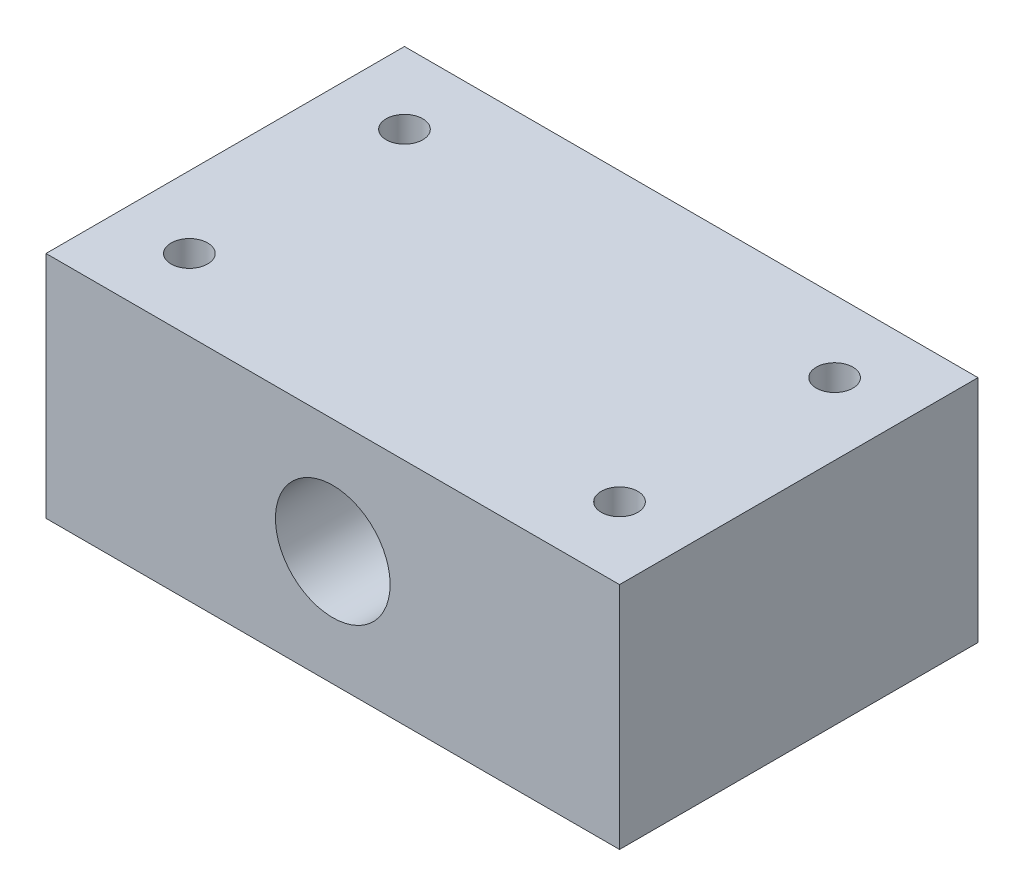
ISO-10303-21;
HEADER;
FILE_DESCRIPTION(('STEP AP214'),'2;1');
FILE_NAME('part.step','',(''),(''),'','','');
FILE_SCHEMA(('AUTOMOTIVE_DESIGN { 1 0 10303 214 1 1 1 1 }'));
ENDSEC;
DATA;
#1=APPLICATION_CONTEXT('core data for automotive mechanical design processes');
#2=APPLICATION_PROTOCOL_DEFINITION('international standard','automotive_design',2000,#1);
#3=PRODUCT_CONTEXT('',#1,'mechanical');
#4=PRODUCT('Part','Part','',(#3));
#5=PRODUCT_RELATED_PRODUCT_CATEGORY('part','',(#4));
#6=PRODUCT_DEFINITION_FORMATION('','',#4);
#7=PRODUCT_DEFINITION_CONTEXT('part definition',#1,'design');
#8=PRODUCT_DEFINITION('design','',#6,#7);
#9=PRODUCT_DEFINITION_SHAPE('','',#8);
#10=(LENGTH_UNIT() NAMED_UNIT(*) SI_UNIT(.MILLI.,.METRE.));
#11=(NAMED_UNIT(*) PLANE_ANGLE_UNIT() SI_UNIT($,.RADIAN.));
#12=(NAMED_UNIT(*) SI_UNIT($,.STERADIAN.) SOLID_ANGLE_UNIT());
#13=UNCERTAINTY_MEASURE_WITH_UNIT(LENGTH_MEASURE(1.E-05),#10,'distance_accuracy_value','');
#14=(GEOMETRIC_REPRESENTATION_CONTEXT(3) GLOBAL_UNCERTAINTY_ASSIGNED_CONTEXT((#13)) GLOBAL_UNIT_ASSIGNED_CONTEXT((#10,
#11,#12)) REPRESENTATION_CONTEXT('',''));
#15=CARTESIAN_POINT('',(0.,0.,0.));
#16=DIRECTION('',(0.,0.,1.));
#17=DIRECTION('',(1.,0.,0.));
#18=AXIS2_PLACEMENT_3D('',#15,#16,#17);
#19=CARTESIAN_POINT('',(0.,32.,0.));
#20=DIRECTION('',(0.,1.,0.));
#21=DIRECTION('',(0.,0.,1.));
#22=AXIS2_PLACEMENT_3D('',#19,#20,#21);
#23=PLANE('',#22);
#24=CARTESIAN_POINT('',(30.,32.,15.));
#25=DIRECTION('',(0.,1.,0.));
#26=DIRECTION('',(0.,0.,1.));
#27=AXIS2_PLACEMENT_3D('',#24,#25,#26);
#28=CIRCLE('',#27,2.55);
#29=CARTESIAN_POINT('',(30.,32.,17.55));
#30=VERTEX_POINT('',#29);
#31=EDGE_CURVE('E121',#30,#30,#28,.T.);
#32=ORIENTED_EDGE('',*,*,#31,.F.);
#33=EDGE_LOOP('',(#32));
#34=FACE_BOUND('',#33,.T.);
#35=CARTESIAN_POINT('',(-30.,32.,-15.));
#36=DIRECTION('',(0.,1.,0.));
#37=DIRECTION('',(0.,0.,1.));
#38=AXIS2_PLACEMENT_3D('',#35,#36,#37);
#39=CIRCLE('',#38,2.55);
#40=CARTESIAN_POINT('',(-30.,32.,-12.45));
#41=VERTEX_POINT('',#40);
#42=EDGE_CURVE('E100',#41,#41,#39,.T.);
#43=ORIENTED_EDGE('',*,*,#42,.F.);
#44=EDGE_LOOP('',(#43));
#45=FACE_BOUND('',#44,.T.);
#46=DIRECTION('',(0.,0.,-1.));
#47=VECTOR('',#46,1.);
#48=CARTESIAN_POINT('',(40.,32.,-25.));
#49=LINE('',#48,#47);
#50=CARTESIAN_POINT('',(40.,32.,25.));
#51=VERTEX_POINT('',#50);
#52=CARTESIAN_POINT('',(40.,32.,-25.));
#53=VERTEX_POINT('',#52);
#54=EDGE_CURVE('E85',#51,#53,#49,.T.);
#55=ORIENTED_EDGE('',*,*,#54,.T.);
#56=DIRECTION('',(-1.,0.,0.));
#57=VECTOR('',#56,1.);
#58=CARTESIAN_POINT('',(-40.,32.,-25.));
#59=LINE('',#58,#57);
#60=CARTESIAN_POINT('',(-40.,32.,-25.));
#61=VERTEX_POINT('',#60);
#62=EDGE_CURVE('E80',#53,#61,#59,.T.);
#63=ORIENTED_EDGE('',*,*,#62,.T.);
#64=DIRECTION('',(0.,0.,1.));
#65=VECTOR('',#64,1.);
#66=CARTESIAN_POINT('',(-40.,32.,-25.));
#67=LINE('',#66,#65);
#68=CARTESIAN_POINT('',(-40.,32.,25.));
#69=VERTEX_POINT('',#68);
#70=EDGE_CURVE('E83',#61,#69,#67,.T.);
#71=ORIENTED_EDGE('',*,*,#70,.T.);
#72=DIRECTION('',(1.,0.,0.));
#73=VECTOR('',#72,1.);
#74=CARTESIAN_POINT('',(-40.,32.,25.));
#75=LINE('',#74,#73);
#76=EDGE_CURVE('E50',#69,#51,#75,.T.);
#77=ORIENTED_EDGE('',*,*,#76,.T.);
#78=EDGE_LOOP('',(#55,#63,#71,#77));
#79=FACE_BOUND('',#78,.T.);
#80=CARTESIAN_POINT('',(30.,32.,-15.));
#81=DIRECTION('',(0.,1.,0.));
#82=DIRECTION('',(0.,0.,-1.));
#83=AXIS2_PLACEMENT_3D('',#80,#81,#82);
#84=CIRCLE('',#83,2.55);
#85=CARTESIAN_POINT('',(30.,32.,-17.55));
#86=VERTEX_POINT('',#85);
#87=EDGE_CURVE('E115',#86,#86,#84,.T.);
#88=ORIENTED_EDGE('',*,*,#87,.F.);
#89=EDGE_LOOP('',(#88));
#90=FACE_BOUND('',#89,.T.);
#91=CARTESIAN_POINT('',(-30.,32.,15.));
#92=DIRECTION('',(0.,1.,0.));
#93=DIRECTION('',(0.,0.,-1.));
#94=AXIS2_PLACEMENT_3D('',#91,#92,#93);
#95=CIRCLE('',#94,2.55);
#96=CARTESIAN_POINT('',(-30.,32.,12.45));
#97=VERTEX_POINT('',#96);
#98=EDGE_CURVE('E127',#97,#97,#95,.T.);
#99=ORIENTED_EDGE('',*,*,#98,.F.);
#100=EDGE_LOOP('',(#99));
#101=FACE_BOUND('',#100,.T.);
#102=ADVANCED_FACE('F33',(#34,#45,#79,#90,#101),#23,.T.);
#103=CARTESIAN_POINT('',(0.,0.,0.));
#104=DIRECTION('',(0.,1.,0.));
#105=DIRECTION('',(0.,0.,1.));
#106=AXIS2_PLACEMENT_3D('',#103,#104,#105);
#107=PLANE('',#106);
#108=DIRECTION('',(0.,0.,-1.));
#109=VECTOR('',#108,1.);
#110=CARTESIAN_POINT('',(40.,0.,-25.));
#111=LINE('',#110,#109);
#112=CARTESIAN_POINT('',(40.,0.,25.));
#113=VERTEX_POINT('',#112);
#114=CARTESIAN_POINT('',(40.,0.,-25.));
#115=VERTEX_POINT('',#114);
#116=EDGE_CURVE('E97',#113,#115,#111,.T.);
#117=ORIENTED_EDGE('',*,*,#116,.F.);
#118=DIRECTION('',(1.,0.,0.));
#119=VECTOR('',#118,1.);
#120=CARTESIAN_POINT('',(-40.,0.,25.));
#121=LINE('',#120,#119);
#122=CARTESIAN_POINT('',(-40.,0.,25.));
#123=VERTEX_POINT('',#122);
#124=EDGE_CURVE('E73',#123,#113,#121,.T.);
#125=ORIENTED_EDGE('',*,*,#124,.F.);
#126=DIRECTION('',(0.,0.,1.));
#127=VECTOR('',#126,1.);
#128=CARTESIAN_POINT('',(-40.,0.,-25.));
#129=LINE('',#128,#127);
#130=CARTESIAN_POINT('',(-40.,0.,-25.));
#131=VERTEX_POINT('',#130);
#132=EDGE_CURVE('E67',#131,#123,#129,.T.);
#133=ORIENTED_EDGE('',*,*,#132,.F.);
#134=DIRECTION('',(-1.,0.,0.));
#135=VECTOR('',#134,1.);
#136=CARTESIAN_POINT('',(-40.,0.,-25.));
#137=LINE('',#136,#135);
#138=EDGE_CURVE('E89',#115,#131,#137,.T.);
#139=ORIENTED_EDGE('',*,*,#138,.F.);
#140=EDGE_LOOP('',(#117,#125,#133,#139));
#141=FACE_BOUND('',#140,.T.);
#142=CARTESIAN_POINT('',(-30.,0.,-15.));
#143=DIRECTION('',(0.,1.,0.));
#144=DIRECTION('',(0.,0.,1.));
#145=AXIS2_PLACEMENT_3D('',#142,#143,#144);
#146=CIRCLE('',#145,2.55);
#147=CARTESIAN_POINT('',(-30.,0.,-12.45));
#148=VERTEX_POINT('',#147);
#149=EDGE_CURVE('E112',#148,#148,#146,.T.);
#150=ORIENTED_EDGE('',*,*,#149,.T.);
#151=EDGE_LOOP('',(#150));
#152=FACE_BOUND('',#151,.T.);
#153=CARTESIAN_POINT('',(30.,0.,-15.));
#154=DIRECTION('',(0.,1.,0.));
#155=DIRECTION('',(0.,0.,-1.));
#156=AXIS2_PLACEMENT_3D('',#153,#154,#155);
#157=CIRCLE('',#156,2.55);
#158=CARTESIAN_POINT('',(30.,0.,-17.55));
#159=VERTEX_POINT('',#158);
#160=EDGE_CURVE('E118',#159,#159,#157,.T.);
#161=ORIENTED_EDGE('',*,*,#160,.T.);
#162=EDGE_LOOP('',(#161));
#163=FACE_BOUND('',#162,.T.);
#164=CARTESIAN_POINT('',(30.,0.,15.));
#165=DIRECTION('',(0.,1.,0.));
#166=DIRECTION('',(0.,0.,1.));
#167=AXIS2_PLACEMENT_3D('',#164,#165,#166);
#168=CIRCLE('',#167,2.55);
#169=CARTESIAN_POINT('',(30.,0.,17.55));
#170=VERTEX_POINT('',#169);
#171=EDGE_CURVE('E124',#170,#170,#168,.T.);
#172=ORIENTED_EDGE('',*,*,#171,.T.);
#173=EDGE_LOOP('',(#172));
#174=FACE_BOUND('',#173,.T.);
#175=CARTESIAN_POINT('',(-30.,0.,15.));
#176=DIRECTION('',(0.,1.,0.));
#177=DIRECTION('',(0.,0.,-1.));
#178=AXIS2_PLACEMENT_3D('',#175,#176,#177);
#179=CIRCLE('',#178,2.55);
#180=CARTESIAN_POINT('',(-30.,0.,12.45));
#181=VERTEX_POINT('',#180);
#182=EDGE_CURVE('E130',#181,#181,#179,.T.);
#183=ORIENTED_EDGE('',*,*,#182,.T.);
#184=EDGE_LOOP('',(#183));
#185=FACE_BOUND('',#184,.T.);
#186=ADVANCED_FACE('F108',(#141,#152,#163,#174,#185),#107,.F.);
#187=CARTESIAN_POINT('',(40.,32.,-25.));
#188=DIRECTION('',(-1.,0.,0.));
#189=DIRECTION('',(0.,0.,1.));
#190=AXIS2_PLACEMENT_3D('',#187,#188,#189);
#191=PLANE('',#190);
#192=ORIENTED_EDGE('',*,*,#116,.T.);
#193=DIRECTION('',(0.,-1.,0.));
#194=VECTOR('',#193,1.);
#195=CARTESIAN_POINT('',(40.,32.,-25.));
#196=LINE('',#195,#194);
#197=EDGE_CURVE('E11',#53,#115,#196,.T.);
#198=ORIENTED_EDGE('',*,*,#197,.F.);
#199=ORIENTED_EDGE('',*,*,#54,.F.);
#200=DIRECTION('',(0.,-1.,0.));
#201=VECTOR('',#200,1.);
#202=CARTESIAN_POINT('',(40.,32.,25.));
#203=LINE('',#202,#201);
#204=EDGE_CURVE('E93',#51,#113,#203,.T.);
#205=ORIENTED_EDGE('',*,*,#204,.T.);
#206=EDGE_LOOP('',(#192,#198,#199,#205));
#207=FACE_BOUND('',#206,.T.);
#208=ADVANCED_FACE('F35',(#207),#191,.F.);
#209=CARTESIAN_POINT('',(-40.,32.,-25.));
#210=DIRECTION('',(0.,0.,1.));
#211=DIRECTION('',(1.,0.,0.));
#212=AXIS2_PLACEMENT_3D('',#209,#210,#211);
#213=PLANE('',#212);
#214=CARTESIAN_POINT('',(0.,16.,-25.));
#215=DIRECTION('',(0.,0.,1.));
#216=DIRECTION('',(1.,0.,0.));
#217=AXIS2_PLACEMENT_3D('',#214,#215,#216);
#218=CIRCLE('',#217,8.);
#219=CARTESIAN_POINT('',(8.,16.,-25.));
#220=VERTEX_POINT('',#219);
#221=EDGE_CURVE('E133',#220,#220,#218,.T.);
#222=ORIENTED_EDGE('',*,*,#221,.T.);
#223=EDGE_LOOP('',(#222));
#224=FACE_BOUND('',#223,.T.);
#225=ORIENTED_EDGE('',*,*,#138,.T.);
#226=DIRECTION('',(0.,-1.,0.));
#227=VECTOR('',#226,1.);
#228=CARTESIAN_POINT('',(-40.,32.,-25.));
#229=LINE('',#228,#227);
#230=EDGE_CURVE('E42',#61,#131,#229,.T.);
#231=ORIENTED_EDGE('',*,*,#230,.F.);
#232=ORIENTED_EDGE('',*,*,#62,.F.);
#233=ORIENTED_EDGE('',*,*,#197,.T.);
#234=EDGE_LOOP('',(#225,#231,#232,#233));
#235=FACE_BOUND('',#234,.T.);
#236=ADVANCED_FACE('F88',(#224,#235),#213,.F.);
#237=CARTESIAN_POINT('',(-40.,32.,-25.));
#238=DIRECTION('',(1.,0.,0.));
#239=DIRECTION('',(0.,0.,-1.));
#240=AXIS2_PLACEMENT_3D('',#237,#238,#239);
#241=PLANE('',#240);
#242=ORIENTED_EDGE('',*,*,#132,.T.);
#243=DIRECTION('',(0.,-1.,0.));
#244=VECTOR('',#243,1.);
#245=CARTESIAN_POINT('',(-40.,32.,25.));
#246=LINE('',#245,#244);
#247=EDGE_CURVE('E90',#69,#123,#246,.T.);
#248=ORIENTED_EDGE('',*,*,#247,.F.);
#249=ORIENTED_EDGE('',*,*,#70,.F.);
#250=ORIENTED_EDGE('',*,*,#230,.T.);
#251=EDGE_LOOP('',(#242,#248,#249,#250));
#252=FACE_BOUND('',#251,.T.);
#253=ADVANCED_FACE('F91',(#252),#241,.F.);
#254=CARTESIAN_POINT('',(-40.,32.,25.));
#255=DIRECTION('',(0.,0.,-1.));
#256=DIRECTION('',(-1.,0.,0.));
#257=AXIS2_PLACEMENT_3D('',#254,#255,#256);
#258=PLANE('',#257);
#259=CARTESIAN_POINT('',(0.,16.,25.));
#260=DIRECTION('',(0.,0.,1.));
#261=DIRECTION('',(1.,0.,0.));
#262=AXIS2_PLACEMENT_3D('',#259,#260,#261);
#263=CIRCLE('',#262,8.);
#264=CARTESIAN_POINT('',(8.,16.,25.));
#265=VERTEX_POINT('',#264);
#266=EDGE_CURVE('E136',#265,#265,#263,.T.);
#267=ORIENTED_EDGE('',*,*,#266,.F.);
#268=EDGE_LOOP('',(#267));
#269=FACE_BOUND('',#268,.T.);
#270=ORIENTED_EDGE('',*,*,#124,.T.);
#271=ORIENTED_EDGE('',*,*,#204,.F.);
#272=ORIENTED_EDGE('',*,*,#76,.F.);
#273=ORIENTED_EDGE('',*,*,#247,.T.);
#274=EDGE_LOOP('',(#270,#271,#272,#273));
#275=FACE_BOUND('',#274,.T.);
#276=ADVANCED_FACE('F105',(#269,#275),#258,.F.);
#277=CARTESIAN_POINT('',(-30.,32.,-15.));
#278=DIRECTION('',(0.,-1.,0.));
#279=DIRECTION('',(0.,0.,-1.));
#280=AXIS2_PLACEMENT_3D('',#277,#278,#279);
#281=CYLINDRICAL_SURFACE('',#280,2.55);
#282=ORIENTED_EDGE('',*,*,#42,.T.);
#283=EDGE_LOOP('',(#282));
#284=FACE_BOUND('',#283,.T.);
#285=ORIENTED_EDGE('',*,*,#149,.F.);
#286=EDGE_LOOP('',(#285));
#287=FACE_BOUND('',#286,.T.);
#288=ADVANCED_FACE('F151',(#284,#287),#281,.F.);
#289=CARTESIAN_POINT('',(30.,32.,-15.));
#290=DIRECTION('',(0.,-1.,0.));
#291=DIRECTION('',(0.,0.,-1.));
#292=AXIS2_PLACEMENT_3D('',#289,#290,#291);
#293=CYLINDRICAL_SURFACE('',#292,2.55);
#294=ORIENTED_EDGE('',*,*,#87,.T.);
#295=EDGE_LOOP('',(#294));
#296=FACE_BOUND('',#295,.T.);
#297=ORIENTED_EDGE('',*,*,#160,.F.);
#298=EDGE_LOOP('',(#297));
#299=FACE_BOUND('',#298,.T.);
#300=ADVANCED_FACE('F157',(#296,#299),#293,.F.);
#301=CARTESIAN_POINT('',(30.,32.,15.));
#302=DIRECTION('',(0.,-1.,0.));
#303=DIRECTION('',(0.,0.,-1.));
#304=AXIS2_PLACEMENT_3D('',#301,#302,#303);
#305=CYLINDRICAL_SURFACE('',#304,2.55);
#306=ORIENTED_EDGE('',*,*,#31,.T.);
#307=EDGE_LOOP('',(#306));
#308=FACE_BOUND('',#307,.T.);
#309=ORIENTED_EDGE('',*,*,#171,.F.);
#310=EDGE_LOOP('',(#309));
#311=FACE_BOUND('',#310,.T.);
#312=ADVANCED_FACE('F173',(#308,#311),#305,.F.);
#313=CARTESIAN_POINT('',(-30.,32.,15.));
#314=DIRECTION('',(0.,-1.,0.));
#315=DIRECTION('',(0.,0.,-1.));
#316=AXIS2_PLACEMENT_3D('',#313,#314,#315);
#317=CYLINDRICAL_SURFACE('',#316,2.55);
#318=ORIENTED_EDGE('',*,*,#98,.T.);
#319=EDGE_LOOP('',(#318));
#320=FACE_BOUND('',#319,.T.);
#321=ORIENTED_EDGE('',*,*,#182,.F.);
#322=EDGE_LOOP('',(#321));
#323=FACE_BOUND('',#322,.T.);
#324=ADVANCED_FACE('F146',(#320,#323),#317,.F.);
#325=CARTESIAN_POINT('',(0.,16.,-25.));
#326=DIRECTION('',(0.,0.,1.));
#327=DIRECTION('',(1.,0.,0.));
#328=AXIS2_PLACEMENT_3D('',#325,#326,#327);
#329=CYLINDRICAL_SURFACE('',#328,8.);
#330=ORIENTED_EDGE('',*,*,#221,.F.);
#331=EDGE_LOOP('',(#330));
#332=FACE_BOUND('',#331,.T.);
#333=ORIENTED_EDGE('',*,*,#266,.T.);
#334=EDGE_LOOP('',(#333));
#335=FACE_BOUND('',#334,.T.);
#336=ADVANCED_FACE('F143',(#332,#335),#329,.F.);
#337=CLOSED_SHELL('',(#102,#186,#208,#236,#253,#276,#288,#300,#312,#324,#336));
#338=MANIFOLD_SOLID_BREP('B2',#337);
#339=ADVANCED_BREP_SHAPE_REPRESENTATION('',(#18,#338),#14);
#340=SHAPE_DEFINITION_REPRESENTATION(#9,#339);
ENDSEC;
END-ISO-10303-21;
